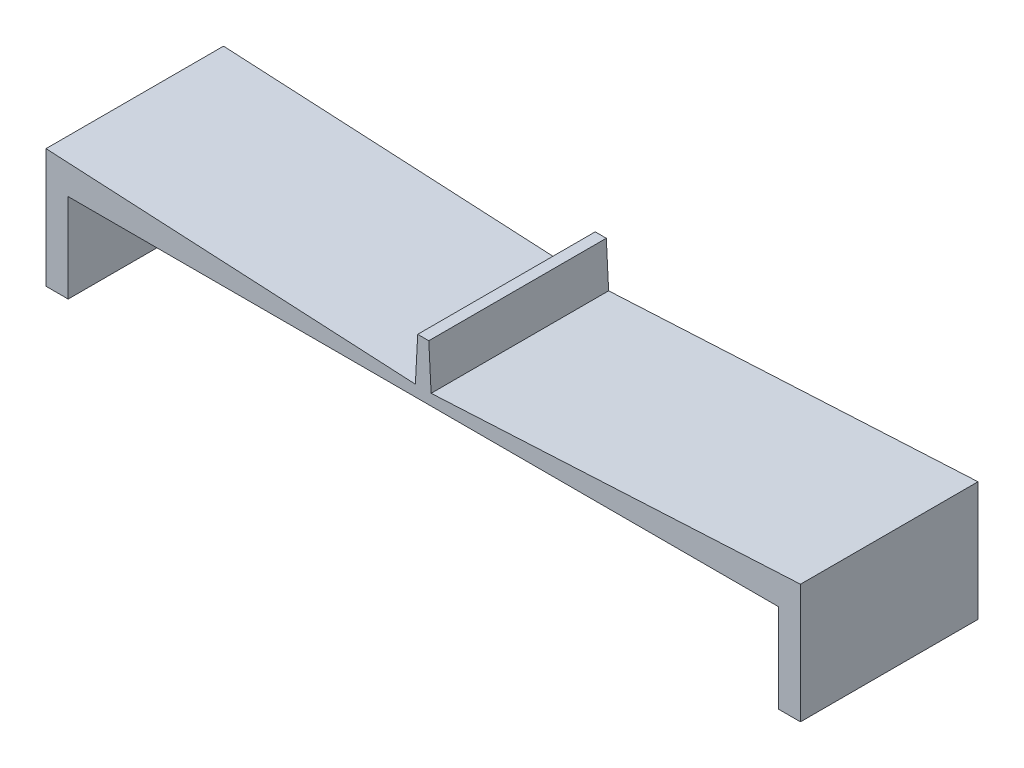
ISO-10303-21;
HEADER;
FILE_DESCRIPTION(('STEP AP214'),'2;1');
FILE_NAME('part.step','',(''),(''),'','','');
FILE_SCHEMA(('AUTOMOTIVE_DESIGN { 1 0 10303 214 1 1 1 1 }'));
ENDSEC;
DATA;
#1=APPLICATION_CONTEXT('core data for automotive mechanical design processes');
#2=APPLICATION_PROTOCOL_DEFINITION('international standard','automotive_design',2000,#1);
#3=PRODUCT_CONTEXT('',#1,'mechanical');
#4=PRODUCT('Part','Part','',(#3));
#5=PRODUCT_RELATED_PRODUCT_CATEGORY('part','',(#4));
#6=PRODUCT_DEFINITION_FORMATION('','',#4);
#7=PRODUCT_DEFINITION_CONTEXT('part definition',#1,'design');
#8=PRODUCT_DEFINITION('design','',#6,#7);
#9=PRODUCT_DEFINITION_SHAPE('','',#8);
#10=(LENGTH_UNIT() NAMED_UNIT(*) SI_UNIT(.MILLI.,.METRE.));
#11=(NAMED_UNIT(*) PLANE_ANGLE_UNIT() SI_UNIT($,.RADIAN.));
#12=(NAMED_UNIT(*) SI_UNIT($,.STERADIAN.) SOLID_ANGLE_UNIT());
#13=UNCERTAINTY_MEASURE_WITH_UNIT(LENGTH_MEASURE(1.E-05),#10,'distance_accuracy_value','');
#14=(GEOMETRIC_REPRESENTATION_CONTEXT(3) GLOBAL_UNCERTAINTY_ASSIGNED_CONTEXT((#13)) GLOBAL_UNIT_ASSIGNED_CONTEXT((#10,
#11,#12)) REPRESENTATION_CONTEXT('',''));
#15=CARTESIAN_POINT('',(0.,0.,0.));
#16=DIRECTION('',(0.,0.,1.));
#17=DIRECTION('',(1.,0.,0.));
#18=AXIS2_PLACEMENT_3D('',#15,#16,#17);
#19=CARTESIAN_POINT('',(0.,0.,25.4));
#20=DIRECTION('',(0.,1.,0.));
#21=DIRECTION('',(0.,0.,1.));
#22=AXIS2_PLACEMENT_3D('',#19,#20,#21);
#23=PLANE('',#22);
#24=DIRECTION('',(1.,0.,0.));
#25=VECTOR('',#24,1.);
#26=CARTESIAN_POINT('',(0.,0.,0.));
#27=LINE('',#26,#25);
#28=CARTESIAN_POINT('',(-50.8,0.,0.));
#29=VERTEX_POINT('',#28);
#30=CARTESIAN_POINT('',(50.8,0.,0.));
#31=VERTEX_POINT('',#30);
#32=EDGE_CURVE('E132',#29,#31,#27,.T.);
#33=ORIENTED_EDGE('',*,*,#32,.T.);
#34=DIRECTION('',(0.,0.,-1.));
#35=VECTOR('',#34,1.);
#36=CARTESIAN_POINT('',(50.8,0.,25.4));
#37=LINE('',#36,#35);
#38=CARTESIAN_POINT('',(50.8,0.,25.4));
#39=VERTEX_POINT('',#38);
#40=EDGE_CURVE('E11',#39,#31,#37,.T.);
#41=ORIENTED_EDGE('',*,*,#40,.F.);
#42=DIRECTION('',(1.,0.,0.));
#43=VECTOR('',#42,1.);
#44=CARTESIAN_POINT('',(0.,0.,25.4));
#45=LINE('',#44,#43);
#46=CARTESIAN_POINT('',(-50.8,0.,25.4));
#47=VERTEX_POINT('',#46);
#48=EDGE_CURVE('E151',#47,#39,#45,.T.);
#49=ORIENTED_EDGE('',*,*,#48,.F.);
#50=DIRECTION('',(0.,0.,-1.));
#51=VECTOR('',#50,1.);
#52=CARTESIAN_POINT('',(-50.8,0.,25.4));
#53=LINE('',#52,#51);
#54=EDGE_CURVE('E181',#47,#29,#53,.T.);
#55=ORIENTED_EDGE('',*,*,#54,.T.);
#56=EDGE_LOOP('',(#33,#41,#49,#55));
#57=FACE_BOUND('',#56,.T.);
#58=ADVANCED_FACE('F43',(#57),#23,.F.);
#59=CARTESIAN_POINT('',(50.8,0.,25.4));
#60=DIRECTION('',(1.,0.,0.));
#61=DIRECTION('',(0.,0.,-1.));
#62=AXIS2_PLACEMENT_3D('',#59,#60,#61);
#63=PLANE('',#62);
#64=DIRECTION('',(0.,-1.,0.));
#65=VECTOR('',#64,1.);
#66=CARTESIAN_POINT('',(50.8,0.,0.));
#67=LINE('',#66,#65);
#68=CARTESIAN_POINT('',(50.8,-12.7,0.));
#69=VERTEX_POINT('',#68);
#70=EDGE_CURVE('E135',#31,#69,#67,.T.);
#71=ORIENTED_EDGE('',*,*,#70,.T.);
#72=DIRECTION('',(0.,0.,-1.));
#73=VECTOR('',#72,1.);
#74=CARTESIAN_POINT('',(50.8,-12.7,25.4));
#75=LINE('',#74,#73);
#76=CARTESIAN_POINT('',(50.8,-12.7,25.4));
#77=VERTEX_POINT('',#76);
#78=EDGE_CURVE('E51',#77,#69,#75,.T.);
#79=ORIENTED_EDGE('',*,*,#78,.F.);
#80=DIRECTION('',(0.,-1.,0.));
#81=VECTOR('',#80,1.);
#82=CARTESIAN_POINT('',(50.8,0.,25.4));
#83=LINE('',#82,#81);
#84=EDGE_CURVE('E92',#39,#77,#83,.T.);
#85=ORIENTED_EDGE('',*,*,#84,.F.);
#86=ORIENTED_EDGE('',*,*,#40,.T.);
#87=EDGE_LOOP('',(#71,#79,#85,#86));
#88=FACE_BOUND('',#87,.T.);
#89=ADVANCED_FACE('F157',(#88),#63,.F.);
#90=CARTESIAN_POINT('',(0.,-12.7,25.4));
#91=DIRECTION('',(0.,-1.,0.));
#92=DIRECTION('',(0.,0.,-1.));
#93=AXIS2_PLACEMENT_3D('',#90,#91,#92);
#94=PLANE('',#93);
#95=DIRECTION('',(-1.,0.,0.));
#96=VECTOR('',#95,1.);
#97=CARTESIAN_POINT('',(0.,-12.7,0.));
#98=LINE('',#97,#96);
#99=CARTESIAN_POINT('',(53.975,-12.7,0.));
#100=VERTEX_POINT('',#99);
#101=EDGE_CURVE('E139',#100,#69,#98,.T.);
#102=ORIENTED_EDGE('',*,*,#101,.F.);
#103=DIRECTION('',(0.,0.,-1.));
#104=VECTOR('',#103,1.);
#105=CARTESIAN_POINT('',(53.975,-12.7,25.4));
#106=LINE('',#105,#104);
#107=CARTESIAN_POINT('',(53.975,-12.7,25.4));
#108=VERTEX_POINT('',#107);
#109=EDGE_CURVE('E122',#108,#100,#106,.T.);
#110=ORIENTED_EDGE('',*,*,#109,.F.);
#111=DIRECTION('',(-1.,0.,0.));
#112=VECTOR('',#111,1.);
#113=CARTESIAN_POINT('',(0.,-12.7,25.4));
#114=LINE('',#113,#112);
#115=EDGE_CURVE('E112',#108,#77,#114,.T.);
#116=ORIENTED_EDGE('',*,*,#115,.T.);
#117=ORIENTED_EDGE('',*,*,#78,.T.);
#118=EDGE_LOOP('',(#102,#110,#116,#117));
#119=FACE_BOUND('',#118,.T.);
#120=ADVANCED_FACE('F156',(#119),#94,.T.);
#121=CARTESIAN_POINT('',(53.975,0.,25.4));
#122=DIRECTION('',(-1.,0.,0.));
#123=DIRECTION('',(0.,0.,1.));
#124=AXIS2_PLACEMENT_3D('',#121,#122,#123);
#125=PLANE('',#124);
#126=DIRECTION('',(0.,1.,0.));
#127=VECTOR('',#126,1.);
#128=CARTESIAN_POINT('',(53.975,0.,0.));
#129=LINE('',#128,#127);
#130=CARTESIAN_POINT('',(53.975,4.3571704586547,0.));
#131=VERTEX_POINT('',#130);
#132=EDGE_CURVE('E119',#100,#131,#129,.T.);
#133=ORIENTED_EDGE('',*,*,#132,.T.);
#134=DIRECTION('',(0.,0.,-1.));
#135=VECTOR('',#134,1.);
#136=CARTESIAN_POINT('',(53.975,4.3571704586547,25.4));
#137=LINE('',#136,#135);
#138=CARTESIAN_POINT('',(53.975,4.3571704586547,25.4));
#139=VERTEX_POINT('',#138);
#140=EDGE_CURVE('E116',#139,#131,#137,.T.);
#141=ORIENTED_EDGE('',*,*,#140,.F.);
#142=DIRECTION('',(0.,1.,0.));
#143=VECTOR('',#142,1.);
#144=CARTESIAN_POINT('',(53.975,0.,25.4));
#145=LINE('',#144,#143);
#146=EDGE_CURVE('E106',#108,#139,#145,.T.);
#147=ORIENTED_EDGE('',*,*,#146,.F.);
#148=ORIENTED_EDGE('',*,*,#109,.T.);
#149=EDGE_LOOP('',(#133,#141,#147,#148));
#150=FACE_BOUND('',#149,.T.);
#151=ADVANCED_FACE('F117',(#150),#125,.F.);
#152=CARTESIAN_POINT('',(-0.0798838173704723,1.52427403838348,25.4));
#153=DIRECTION('',(-0.0523359562429444,0.998629534754574,0.));
#154=DIRECTION('',(-0.998629534754574,-0.0523359562429444,0.));
#155=AXIS2_PLACEMENT_3D('',#152,#153,#154);
#156=PLANE('',#155);
#157=DIRECTION('',(0.998629534754574,0.0523359562429444,0.));
#158=VECTOR('',#157,1.);
#159=CARTESIAN_POINT('',(-0.0798838173704723,1.52427403838348,0.));
#160=LINE('',#159,#158);
#161=CARTESIAN_POINT('',(1.12653939844732,1.5875,0.));
#162=VERTEX_POINT('',#161);
#163=EDGE_CURVE('E143',#162,#131,#160,.T.);
#164=ORIENTED_EDGE('',*,*,#163,.F.);
#165=DIRECTION('',(0.,0.,-1.));
#166=VECTOR('',#165,1.);
#167=CARTESIAN_POINT('',(1.12653939844732,1.5875,25.4));
#168=LINE('',#167,#166);
#169=CARTESIAN_POINT('',(1.12653939844732,1.5875,25.4));
#170=VERTEX_POINT('',#169);
#171=EDGE_CURVE('E80',#170,#162,#168,.T.);
#172=ORIENTED_EDGE('',*,*,#171,.F.);
#173=DIRECTION('',(0.998629534754574,0.0523359562429444,0.));
#174=VECTOR('',#173,1.);
#175=CARTESIAN_POINT('',(-0.0798838173704723,1.52427403838348,25.4));
#176=LINE('',#175,#174);
#177=EDGE_CURVE('E110',#170,#139,#176,.T.);
#178=ORIENTED_EDGE('',*,*,#177,.T.);
#179=ORIENTED_EDGE('',*,*,#140,.T.);
#180=EDGE_LOOP('',(#164,#172,#178,#179));
#181=FACE_BOUND('',#180,.T.);
#182=ADVANCED_FACE('F124',(#181),#156,.T.);
#183=CARTESIAN_POINT('',(1.20642321581779,0.0632259616165162,25.4));
#184=DIRECTION('',(0.998629534754574,0.0523359562429445,0.));
#185=DIRECTION('',(-0.0523359562429445,0.998629534754574,0.));
#186=AXIS2_PLACEMENT_3D('',#183,#184,#185);
#187=PLANE('',#186);
#188=DIRECTION('',(0.0523359562429445,-0.998629534754574,0.));
#189=VECTOR('',#188,1.);
#190=CARTESIAN_POINT('',(1.20642321581779,0.0632259616165162,0.));
#191=LINE('',#190,#189);
#192=CARTESIAN_POINT('',(0.79375,7.9375,0.));
#193=VERTEX_POINT('',#192);
#194=EDGE_CURVE('E145',#193,#162,#191,.T.);
#195=ORIENTED_EDGE('',*,*,#194,.F.);
#196=DIRECTION('',(0.,0.,-1.));
#197=VECTOR('',#196,1.);
#198=CARTESIAN_POINT('',(0.79375,7.9375,25.4));
#199=LINE('',#198,#197);
#200=CARTESIAN_POINT('',(0.79375,7.9375,25.4));
#201=VERTEX_POINT('',#200);
#202=EDGE_CURVE('E59',#201,#193,#199,.T.);
#203=ORIENTED_EDGE('',*,*,#202,.F.);
#204=DIRECTION('',(0.0523359562429445,-0.998629534754574,0.));
#205=VECTOR('',#204,1.);
#206=CARTESIAN_POINT('',(1.20642321581779,0.0632259616165162,25.4));
#207=LINE('',#206,#205);
#208=EDGE_CURVE('E125',#201,#170,#207,.T.);
#209=ORIENTED_EDGE('',*,*,#208,.T.);
#210=ORIENTED_EDGE('',*,*,#171,.T.);
#211=EDGE_LOOP('',(#195,#203,#209,#210));
#212=FACE_BOUND('',#211,.T.);
#213=ADVANCED_FACE('F163',(#212),#187,.T.);
#214=CARTESIAN_POINT('',(0.,7.9375,25.4));
#215=DIRECTION('',(0.,1.,0.));
#216=DIRECTION('',(0.,0.,1.));
#217=AXIS2_PLACEMENT_3D('',#214,#215,#216);
#218=PLANE('',#217);
#219=DIRECTION('',(1.,0.,0.));
#220=VECTOR('',#219,1.);
#221=CARTESIAN_POINT('',(0.,7.9375,0.));
#222=LINE('',#221,#220);
#223=CARTESIAN_POINT('',(-0.79375,7.9375,0.));
#224=VERTEX_POINT('',#223);
#225=EDGE_CURVE('E148',#224,#193,#222,.T.);
#226=ORIENTED_EDGE('',*,*,#225,.F.);
#227=DIRECTION('',(0.,0.,-1.));
#228=VECTOR('',#227,1.);
#229=CARTESIAN_POINT('',(-0.79375,7.9375,25.4));
#230=LINE('',#229,#228);
#231=CARTESIAN_POINT('',(-0.79375,7.9375,25.4));
#232=VERTEX_POINT('',#231);
#233=EDGE_CURVE('E136',#232,#224,#230,.T.);
#234=ORIENTED_EDGE('',*,*,#233,.F.);
#235=DIRECTION('',(1.,0.,0.));
#236=VECTOR('',#235,1.);
#237=CARTESIAN_POINT('',(0.,7.9375,25.4));
#238=LINE('',#237,#236);
#239=EDGE_CURVE('E127',#232,#201,#238,.T.);
#240=ORIENTED_EDGE('',*,*,#239,.T.);
#241=ORIENTED_EDGE('',*,*,#202,.T.);
#242=EDGE_LOOP('',(#226,#234,#240,#241));
#243=FACE_BOUND('',#242,.T.);
#244=ADVANCED_FACE('F165',(#243),#218,.T.);
#245=CARTESIAN_POINT('',(0.,0.,25.4));
#246=DIRECTION('',(0.,0.,1.));
#247=DIRECTION('',(1.,0.,0.));
#248=AXIS2_PLACEMENT_3D('',#245,#246,#247);
#249=PLANE('',#248);
#250=ORIENTED_EDGE('',*,*,#48,.T.);
#251=ORIENTED_EDGE('',*,*,#84,.T.);
#252=ORIENTED_EDGE('',*,*,#115,.F.);
#253=ORIENTED_EDGE('',*,*,#146,.T.);
#254=ORIENTED_EDGE('',*,*,#177,.F.);
#255=ORIENTED_EDGE('',*,*,#208,.F.);
#256=ORIENTED_EDGE('',*,*,#239,.F.);
#257=DIRECTION('',(-0.0523359562429445,-0.998629534754574,0.));
#258=VECTOR('',#257,1.);
#259=CARTESIAN_POINT('',(-1.20642321581779,0.0632259616165162,25.4));
#260=LINE('',#259,#258);
#261=CARTESIAN_POINT('',(-1.12653939844732,1.5875,25.4));
#262=VERTEX_POINT('',#261);
#263=EDGE_CURVE('E221',#232,#262,#260,.T.);
#264=ORIENTED_EDGE('',*,*,#263,.T.);
#265=DIRECTION('',(-0.998629534754574,0.0523359562429444,0.));
#266=VECTOR('',#265,1.);
#267=CARTESIAN_POINT('',(0.0798838173704723,1.52427403838348,25.4));
#268=LINE('',#267,#266);
#269=CARTESIAN_POINT('',(-53.975,4.3571704586547,25.4));
#270=VERTEX_POINT('',#269);
#271=EDGE_CURVE('E225',#262,#270,#268,.T.);
#272=ORIENTED_EDGE('',*,*,#271,.T.);
#273=DIRECTION('',(0.,1.,0.));
#274=VECTOR('',#273,1.);
#275=CARTESIAN_POINT('',(-53.975,0.,25.4));
#276=LINE('',#275,#274);
#277=CARTESIAN_POINT('',(-53.975,-12.7,25.4));
#278=VERTEX_POINT('',#277);
#279=EDGE_CURVE('E242',#278,#270,#276,.T.);
#280=ORIENTED_EDGE('',*,*,#279,.F.);
#281=DIRECTION('',(1.,0.,0.));
#282=VECTOR('',#281,1.);
#283=CARTESIAN_POINT('',(0.,-12.7,25.4));
#284=LINE('',#283,#282);
#285=CARTESIAN_POINT('',(-50.8,-12.7,25.4));
#286=VERTEX_POINT('',#285);
#287=EDGE_CURVE('E244',#278,#286,#284,.T.);
#288=ORIENTED_EDGE('',*,*,#287,.T.);
#289=DIRECTION('',(0.,-1.,0.));
#290=VECTOR('',#289,1.);
#291=CARTESIAN_POINT('',(-50.8,0.,25.4));
#292=LINE('',#291,#290);
#293=EDGE_CURVE('E248',#47,#286,#292,.T.);
#294=ORIENTED_EDGE('',*,*,#293,.F.);
#295=EDGE_LOOP('',(#250,#251,#252,#253,#254,#255,#256,#264,#272,#280,#288,#294));
#296=FACE_BOUND('',#295,.T.);
#297=ADVANCED_FACE('F108',(#296),#249,.T.);
#298=CARTESIAN_POINT('',(0.,0.,0.));
#299=DIRECTION('',(0.,0.,1.));
#300=DIRECTION('',(1.,0.,0.));
#301=AXIS2_PLACEMENT_3D('',#298,#299,#300);
#302=PLANE('',#301);
#303=ORIENTED_EDGE('',*,*,#32,.F.);
#304=DIRECTION('',(0.,-1.,0.));
#305=VECTOR('',#304,1.);
#306=CARTESIAN_POINT('',(-50.8,0.,0.));
#307=LINE('',#306,#305);
#308=CARTESIAN_POINT('',(-50.8,-12.7,0.));
#309=VERTEX_POINT('',#308);
#310=EDGE_CURVE('E186',#29,#309,#307,.T.);
#311=ORIENTED_EDGE('',*,*,#310,.T.);
#312=DIRECTION('',(1.,0.,0.));
#313=VECTOR('',#312,1.);
#314=CARTESIAN_POINT('',(0.,-12.7,0.));
#315=LINE('',#314,#313);
#316=CARTESIAN_POINT('',(-53.975,-12.7,0.));
#317=VERTEX_POINT('',#316);
#318=EDGE_CURVE('E256',#317,#309,#315,.T.);
#319=ORIENTED_EDGE('',*,*,#318,.F.);
#320=DIRECTION('',(0.,1.,0.));
#321=VECTOR('',#320,1.);
#322=CARTESIAN_POINT('',(-53.975,0.,0.));
#323=LINE('',#322,#321);
#324=CARTESIAN_POINT('',(-53.975,4.3571704586547,0.));
#325=VERTEX_POINT('',#324);
#326=EDGE_CURVE('E253',#317,#325,#323,.T.);
#327=ORIENTED_EDGE('',*,*,#326,.T.);
#328=DIRECTION('',(-0.998629534754574,0.0523359562429444,0.));
#329=VECTOR('',#328,1.);
#330=CARTESIAN_POINT('',(0.0798838173704723,1.52427403838348,0.));
#331=LINE('',#330,#329);
#332=CARTESIAN_POINT('',(-1.12653939844732,1.5875,0.));
#333=VERTEX_POINT('',#332);
#334=EDGE_CURVE('E251',#333,#325,#331,.T.);
#335=ORIENTED_EDGE('',*,*,#334,.F.);
#336=DIRECTION('',(-0.0523359562429445,-0.998629534754574,0.));
#337=VECTOR('',#336,1.);
#338=CARTESIAN_POINT('',(-1.20642321581779,0.0632259616165162,0.));
#339=LINE('',#338,#337);
#340=EDGE_CURVE('E234',#224,#333,#339,.T.);
#341=ORIENTED_EDGE('',*,*,#340,.F.);
#342=ORIENTED_EDGE('',*,*,#225,.T.);
#343=ORIENTED_EDGE('',*,*,#194,.T.);
#344=ORIENTED_EDGE('',*,*,#163,.T.);
#345=ORIENTED_EDGE('',*,*,#132,.F.);
#346=ORIENTED_EDGE('',*,*,#101,.T.);
#347=ORIENTED_EDGE('',*,*,#70,.F.);
#348=EDGE_LOOP('',(#303,#311,#319,#327,#335,#341,#342,#343,#344,#345,#346,#347));
#349=FACE_BOUND('',#348,.T.);
#350=ADVANCED_FACE('F161',(#349),#302,.F.);
#351=CARTESIAN_POINT('',(-1.20642321581779,0.0632259616165162,25.4));
#352=DIRECTION('',(0.998629534754574,-0.0523359562429445,0.));
#353=DIRECTION('',(0.0523359562429445,0.998629534754574,0.));
#354=AXIS2_PLACEMENT_3D('',#351,#352,#353);
#355=PLANE('',#354);
#356=ORIENTED_EDGE('',*,*,#340,.T.);
#357=DIRECTION('',(0.,0.,-1.));
#358=VECTOR('',#357,1.);
#359=CARTESIAN_POINT('',(-1.12653939844732,1.5875,25.4));
#360=LINE('',#359,#358);
#361=EDGE_CURVE('E232',#262,#333,#360,.T.);
#362=ORIENTED_EDGE('',*,*,#361,.F.);
#363=ORIENTED_EDGE('',*,*,#263,.F.);
#364=ORIENTED_EDGE('',*,*,#233,.T.);
#365=EDGE_LOOP('',(#356,#362,#363,#364));
#366=FACE_BOUND('',#365,.T.);
#367=ADVANCED_FACE('F233',(#366),#355,.F.);
#368=CARTESIAN_POINT('',(0.0798838173704723,1.52427403838348,25.4));
#369=DIRECTION('',(-0.0523359562429444,-0.998629534754574,0.));
#370=DIRECTION('',(0.998629534754574,-0.0523359562429444,0.));
#371=AXIS2_PLACEMENT_3D('',#368,#369,#370);
#372=PLANE('',#371);
#373=ORIENTED_EDGE('',*,*,#334,.T.);
#374=DIRECTION('',(0.,0.,-1.));
#375=VECTOR('',#374,1.);
#376=CARTESIAN_POINT('',(-53.975,4.3571704586547,25.4));
#377=LINE('',#376,#375);
#378=EDGE_CURVE('E238',#270,#325,#377,.T.);
#379=ORIENTED_EDGE('',*,*,#378,.F.);
#380=ORIENTED_EDGE('',*,*,#271,.F.);
#381=ORIENTED_EDGE('',*,*,#361,.T.);
#382=EDGE_LOOP('',(#373,#379,#380,#381));
#383=FACE_BOUND('',#382,.T.);
#384=ADVANCED_FACE('F240',(#383),#372,.F.);
#385=CARTESIAN_POINT('',(-53.975,0.,25.4));
#386=DIRECTION('',(-1.,0.,0.));
#387=DIRECTION('',(0.,0.,1.));
#388=AXIS2_PLACEMENT_3D('',#385,#386,#387);
#389=PLANE('',#388);
#390=ORIENTED_EDGE('',*,*,#326,.F.);
#391=DIRECTION('',(0.,0.,-1.));
#392=VECTOR('',#391,1.);
#393=CARTESIAN_POINT('',(-53.975,-12.7,25.4));
#394=LINE('',#393,#392);
#395=EDGE_CURVE('E261',#278,#317,#394,.T.);
#396=ORIENTED_EDGE('',*,*,#395,.F.);
#397=ORIENTED_EDGE('',*,*,#279,.T.);
#398=ORIENTED_EDGE('',*,*,#378,.T.);
#399=EDGE_LOOP('',(#390,#396,#397,#398));
#400=FACE_BOUND('',#399,.T.);
#401=ADVANCED_FACE('F274',(#400),#389,.T.);
#402=CARTESIAN_POINT('',(0.,-12.7,25.4));
#403=DIRECTION('',(0.,1.,0.));
#404=DIRECTION('',(0.,0.,1.));
#405=AXIS2_PLACEMENT_3D('',#402,#403,#404);
#406=PLANE('',#405);
#407=ORIENTED_EDGE('',*,*,#318,.T.);
#408=DIRECTION('',(0.,0.,-1.));
#409=VECTOR('',#408,1.);
#410=CARTESIAN_POINT('',(-50.8,-12.7,25.4));
#411=LINE('',#410,#409);
#412=EDGE_CURVE('E196',#286,#309,#411,.T.);
#413=ORIENTED_EDGE('',*,*,#412,.F.);
#414=ORIENTED_EDGE('',*,*,#287,.F.);
#415=ORIENTED_EDGE('',*,*,#395,.T.);
#416=EDGE_LOOP('',(#407,#413,#414,#415));
#417=FACE_BOUND('',#416,.T.);
#418=ADVANCED_FACE('F269',(#417),#406,.F.);
#419=CARTESIAN_POINT('',(-50.8,0.,25.4));
#420=DIRECTION('',(1.,0.,0.));
#421=DIRECTION('',(0.,0.,-1.));
#422=AXIS2_PLACEMENT_3D('',#419,#420,#421);
#423=PLANE('',#422);
#424=ORIENTED_EDGE('',*,*,#310,.F.);
#425=ORIENTED_EDGE('',*,*,#54,.F.);
#426=ORIENTED_EDGE('',*,*,#293,.T.);
#427=ORIENTED_EDGE('',*,*,#412,.T.);
#428=EDGE_LOOP('',(#424,#425,#426,#427));
#429=FACE_BOUND('',#428,.T.);
#430=ADVANCED_FACE('F267',(#429),#423,.T.);
#431=CLOSED_SHELL('',(#58,#89,#120,#151,#182,#213,#244,#297,#350,#367,#384,#401,#418,#430));
#432=MANIFOLD_SOLID_BREP('B2',#431);
#433=ADVANCED_BREP_SHAPE_REPRESENTATION('',(#18,#432),#14);
#434=SHAPE_DEFINITION_REPRESENTATION(#9,#433);
ENDSEC;
END-ISO-10303-21;
